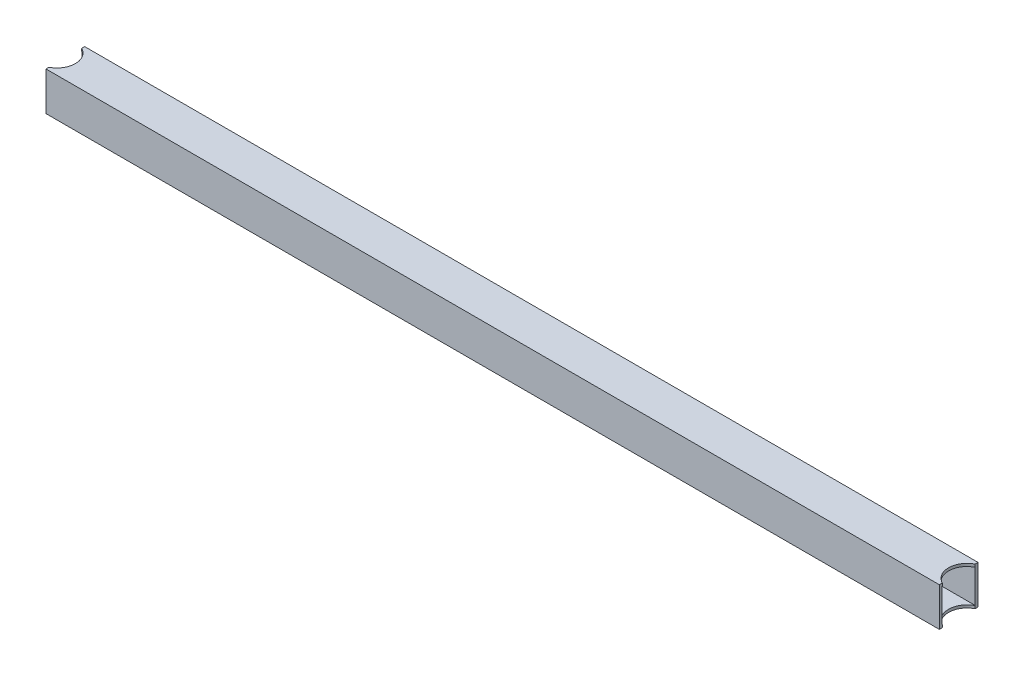
ISO-10303-21;
HEADER;
FILE_DESCRIPTION(('STEP AP214'),'2;1');
FILE_NAME('part.step','',(''),(''),'','','');
FILE_SCHEMA(('AUTOMOTIVE_DESIGN { 1 0 10303 214 1 1 1 1 }'));
ENDSEC;
DATA;
#1=APPLICATION_CONTEXT('core data for automotive mechanical design processes');
#2=APPLICATION_PROTOCOL_DEFINITION('international standard','automotive_design',2000,#1);
#3=PRODUCT_CONTEXT('',#1,'mechanical');
#4=PRODUCT('Part','Part','',(#3));
#5=PRODUCT_RELATED_PRODUCT_CATEGORY('part','',(#4));
#6=PRODUCT_DEFINITION_FORMATION('','',#4);
#7=PRODUCT_DEFINITION_CONTEXT('part definition',#1,'design');
#8=PRODUCT_DEFINITION('design','',#6,#7);
#9=PRODUCT_DEFINITION_SHAPE('','',#8);
#10=(LENGTH_UNIT() NAMED_UNIT(*) SI_UNIT(.MILLI.,.METRE.));
#11=(NAMED_UNIT(*) PLANE_ANGLE_UNIT() SI_UNIT($,.RADIAN.));
#12=(NAMED_UNIT(*) SI_UNIT($,.STERADIAN.) SOLID_ANGLE_UNIT());
#13=UNCERTAINTY_MEASURE_WITH_UNIT(LENGTH_MEASURE(1.E-05),#10,'distance_accuracy_value','');
#14=(GEOMETRIC_REPRESENTATION_CONTEXT(3) GLOBAL_UNCERTAINTY_ASSIGNED_CONTEXT((#13)) GLOBAL_UNIT_ASSIGNED_CONTEXT((#10,
#11,#12)) REPRESENTATION_CONTEXT('',''));
#15=CARTESIAN_POINT('',(0.,0.,0.));
#16=DIRECTION('',(0.,0.,1.));
#17=DIRECTION('',(1.,0.,0.));
#18=AXIS2_PLACEMENT_3D('',#15,#16,#17);
#19=CARTESIAN_POINT('',(522.605,44.45,0.));
#20=DIRECTION('',(0.,-1.,0.));
#21=DIRECTION('',(0.,0.,-1.));
#22=AXIS2_PLACEMENT_3D('',#19,#20,#21);
#23=CYLINDRICAL_SURFACE('',#22,21.0820000000003);
#24=DIRECTION('',(0.,-1.,0.));
#25=VECTOR('',#24,1.);
#26=CARTESIAN_POINT('',(513.08,44.45,-18.8075808917575));
#27=LINE('',#26,#25);
#28=CARTESIAN_POINT('',(513.08,3.17500000000004,-18.8075808917575));
#29=VERTEX_POINT('',#28);
#30=CARTESIAN_POINT('',(513.08,0.,-18.8075808917575));
#31=VERTEX_POINT('',#30);
#32=EDGE_CURVE('E338',#29,#31,#27,.T.);
#33=ORIENTED_EDGE('',*,*,#32,.F.);
#34=CARTESIAN_POINT('',(522.605,3.17500000000004,0.));
#35=DIRECTION('',(0.,-1.,0.));
#36=DIRECTION('',(0.,0.,-1.));
#37=AXIS2_PLACEMENT_3D('',#34,#35,#36);
#38=CIRCLE('',#37,21.0820000000003);
#39=CARTESIAN_POINT('',(513.08,3.17500000000004,18.8075808917578));
#40=VERTEX_POINT('',#39);
#41=EDGE_CURVE('E253',#29,#40,#38,.F.);
#42=ORIENTED_EDGE('',*,*,#41,.T.);
#43=DIRECTION('',(0.,-1.,0.));
#44=VECTOR('',#43,1.);
#45=CARTESIAN_POINT('',(513.08,44.45,18.8075808917575));
#46=LINE('',#45,#44);
#47=CARTESIAN_POINT('',(513.08,0.,18.8075808917575));
#48=VERTEX_POINT('',#47);
#49=EDGE_CURVE('E209',#40,#48,#46,.T.);
#50=ORIENTED_EDGE('',*,*,#49,.T.);
#51=CARTESIAN_POINT('',(522.605,0.,0.));
#52=DIRECTION('',(0.,1.,0.));
#53=DIRECTION('',(0.,0.,1.));
#54=AXIS2_PLACEMENT_3D('',#51,#52,#53);
#55=CIRCLE('',#54,21.0820000000003);
#56=EDGE_CURVE('E290',#48,#31,#55,.F.);
#57=ORIENTED_EDGE('',*,*,#56,.T.);
#58=EDGE_LOOP('',(#33,#42,#50,#57));
#59=FACE_BOUND('',#58,.T.);
#60=ADVANCED_FACE('F42',(#59),#23,.F.);
#61=CARTESIAN_POINT('',(-522.605,44.45,1.28369537222284E-13));
#62=DIRECTION('',(0.,-1.,0.));
#63=DIRECTION('',(0.,0.,-1.));
#64=AXIS2_PLACEMENT_3D('',#61,#62,#63);
#65=CYLINDRICAL_SURFACE('',#64,21.0819999999999);
#66=CARTESIAN_POINT('',(-522.605,3.17500000000004,1.28369537222284E-13));
#67=DIRECTION('',(0.,-1.,0.));
#68=DIRECTION('',(0.,0.,-1.));
#69=AXIS2_PLACEMENT_3D('',#66,#67,#68);
#70=CIRCLE('',#69,21.0819999999999);
#71=CARTESIAN_POINT('',(-513.08,3.17500000000004,-18.8075808917573));
#72=VERTEX_POINT('',#71);
#73=CARTESIAN_POINT('',(-513.08,3.17500000000004,18.8075808917576));
#74=VERTEX_POINT('',#73);
#75=EDGE_CURVE('E250',#72,#74,#70,.T.);
#76=ORIENTED_EDGE('',*,*,#75,.F.);
#77=DIRECTION('',(0.,-1.,0.));
#78=VECTOR('',#77,1.);
#79=CARTESIAN_POINT('',(-513.08,44.45,-18.8075808917574));
#80=LINE('',#79,#78);
#81=CARTESIAN_POINT('',(-513.08,0.,-18.8075808917574));
#82=VERTEX_POINT('',#81);
#83=EDGE_CURVE('E326',#72,#82,#80,.T.);
#84=ORIENTED_EDGE('',*,*,#83,.T.);
#85=CARTESIAN_POINT('',(-522.605,0.,1.28369537222284E-13));
#86=DIRECTION('',(0.,1.,0.));
#87=DIRECTION('',(0.,0.,1.));
#88=AXIS2_PLACEMENT_3D('',#85,#86,#87);
#89=CIRCLE('',#88,21.0819999999999);
#90=CARTESIAN_POINT('',(-513.08,0.,18.8075808917576));
#91=VERTEX_POINT('',#90);
#92=EDGE_CURVE('E305',#91,#82,#89,.T.);
#93=ORIENTED_EDGE('',*,*,#92,.F.);
#94=DIRECTION('',(0.,-1.,0.));
#95=VECTOR('',#94,1.);
#96=CARTESIAN_POINT('',(-513.08,44.45,18.8075808917576));
#97=LINE('',#96,#95);
#98=EDGE_CURVE('E321',#74,#91,#97,.T.);
#99=ORIENTED_EDGE('',*,*,#98,.F.);
#100=EDGE_LOOP('',(#76,#84,#93,#99));
#101=FACE_BOUND('',#100,.T.);
#102=ADVANCED_FACE('F369',(#101),#65,.F.);
#103=CARTESIAN_POINT('',(513.08,44.45,0.));
#104=DIRECTION('',(-1.,0.,0.));
#105=DIRECTION('',(0.,0.,1.));
#106=AXIS2_PLACEMENT_3D('',#103,#104,#105);
#107=PLANE('',#106);
#108=ORIENTED_EDGE('',*,*,#49,.F.);
#109=DIRECTION('',(0.,0.,1.));
#110=VECTOR('',#109,1.);
#111=CARTESIAN_POINT('',(513.08,3.17500000000004,-19.0499999999999));
#112=LINE('',#111,#110);
#113=CARTESIAN_POINT('',(513.08,3.17500000000004,19.0500000000002));
#114=VERTEX_POINT('',#113);
#115=EDGE_CURVE('E190',#40,#114,#112,.T.);
#116=ORIENTED_EDGE('',*,*,#115,.T.);
#117=DIRECTION('',(0.,1.,0.));
#118=VECTOR('',#117,1.);
#119=CARTESIAN_POINT('',(513.08,3.17500000000004,19.0500000000002));
#120=LINE('',#119,#118);
#121=CARTESIAN_POINT('',(513.08,41.2749999999999,19.0500000000002));
#122=VERTEX_POINT('',#121);
#123=EDGE_CURVE('E198',#114,#122,#120,.T.);
#124=ORIENTED_EDGE('',*,*,#123,.T.);
#125=DIRECTION('',(0.,0.,-1.));
#126=VECTOR('',#125,1.);
#127=CARTESIAN_POINT('',(513.08,41.2749999999999,-19.0499999999999));
#128=LINE('',#127,#126);
#129=CARTESIAN_POINT('',(513.08,41.2749999999999,18.8075808917578));
#130=VERTEX_POINT('',#129);
#131=EDGE_CURVE('E221',#122,#130,#128,.T.);
#132=ORIENTED_EDGE('',*,*,#131,.T.);
#133=CARTESIAN_POINT('',(513.08,44.45,18.8075808917575));
#134=VERTEX_POINT('',#133);
#135=EDGE_CURVE('E51',#134,#130,#46,.T.);
#136=ORIENTED_EDGE('',*,*,#135,.F.);
#137=DIRECTION('',(0.,0.,-1.));
#138=VECTOR('',#137,1.);
#139=CARTESIAN_POINT('',(513.08,44.45,0.));
#140=LINE('',#139,#138);
#141=CARTESIAN_POINT('',(513.08,44.45,22.225));
#142=VERTEX_POINT('',#141);
#143=EDGE_CURVE('E257',#142,#134,#140,.T.);
#144=ORIENTED_EDGE('',*,*,#143,.F.);
#145=DIRECTION('',(0.,-1.,0.));
#146=VECTOR('',#145,1.);
#147=CARTESIAN_POINT('',(513.08,44.45,22.225));
#148=LINE('',#147,#146);
#149=CARTESIAN_POINT('',(513.08,0.,22.225));
#150=VERTEX_POINT('',#149);
#151=EDGE_CURVE('E287',#142,#150,#148,.T.);
#152=ORIENTED_EDGE('',*,*,#151,.T.);
#153=DIRECTION('',(0.,0.,-1.));
#154=VECTOR('',#153,1.);
#155=CARTESIAN_POINT('',(513.08,0.,0.));
#156=LINE('',#155,#154);
#157=EDGE_CURVE('E256',#150,#48,#156,.T.);
#158=ORIENTED_EDGE('',*,*,#157,.T.);
#159=EDGE_LOOP('',(#108,#116,#124,#132,#136,#144,#152,#158));
#160=FACE_BOUND('',#159,.T.);
#161=ADVANCED_FACE('F44',(#160),#107,.F.);
#162=ORIENTED_EDGE('',*,*,#135,.T.);
#163=CARTESIAN_POINT('',(522.605,41.2749999999999,0.));
#164=DIRECTION('',(0.,1.,0.));
#165=DIRECTION('',(0.,0.,1.));
#166=AXIS2_PLACEMENT_3D('',#163,#164,#165);
#167=CIRCLE('',#166,21.0820000000003);
#168=CARTESIAN_POINT('',(513.08,41.2749999999999,-18.8075808917575));
#169=VERTEX_POINT('',#168);
#170=EDGE_CURVE('E246',#130,#169,#167,.F.);
#171=ORIENTED_EDGE('',*,*,#170,.T.);
#172=CARTESIAN_POINT('',(513.08,44.45,-18.8075808917575));
#173=VERTEX_POINT('',#172);
#174=EDGE_CURVE('E339',#173,#169,#27,.T.);
#175=ORIENTED_EDGE('',*,*,#174,.F.);
#176=CARTESIAN_POINT('',(522.605,44.45,0.));
#177=DIRECTION('',(0.,1.,0.));
#178=DIRECTION('',(0.,0.,1.));
#179=AXIS2_PLACEMENT_3D('',#176,#177,#178);
#180=CIRCLE('',#179,21.0820000000003);
#181=EDGE_CURVE('E261',#134,#173,#180,.F.);
#182=ORIENTED_EDGE('',*,*,#181,.F.);
#183=EDGE_LOOP('',(#162,#171,#175,#182));
#184=FACE_BOUND('',#183,.T.);
#185=ADVANCED_FACE('F393',(#184),#23,.F.);
#186=CARTESIAN_POINT('',(513.08,44.45,0.));
#187=DIRECTION('',(1.,0.,0.));
#188=DIRECTION('',(0.,0.,-1.));
#189=AXIS2_PLACEMENT_3D('',#186,#187,#188);
#190=PLANE('',#189);
#191=CARTESIAN_POINT('',(513.08,3.17500000000004,-19.0499999999999));
#192=VERTEX_POINT('',#191);
#193=EDGE_CURVE('E205',#192,#29,#112,.T.);
#194=ORIENTED_EDGE('',*,*,#193,.T.);
#195=ORIENTED_EDGE('',*,*,#32,.T.);
#196=DIRECTION('',(0.,0.,1.));
#197=VECTOR('',#196,1.);
#198=CARTESIAN_POINT('',(513.08,0.,0.));
#199=LINE('',#198,#197);
#200=CARTESIAN_POINT('',(513.08,0.,-22.225));
#201=VERTEX_POINT('',#200);
#202=EDGE_CURVE('E294',#201,#31,#199,.T.);
#203=ORIENTED_EDGE('',*,*,#202,.F.);
#204=DIRECTION('',(0.,-1.,0.));
#205=VECTOR('',#204,1.);
#206=CARTESIAN_POINT('',(513.08,44.45,-22.225));
#207=LINE('',#206,#205);
#208=CARTESIAN_POINT('',(513.08,44.45,-22.225));
#209=VERTEX_POINT('',#208);
#210=EDGE_CURVE('E335',#209,#201,#207,.T.);
#211=ORIENTED_EDGE('',*,*,#210,.F.);
#212=DIRECTION('',(0.,0.,1.));
#213=VECTOR('',#212,1.);
#214=CARTESIAN_POINT('',(513.08,44.45,0.));
#215=LINE('',#214,#213);
#216=EDGE_CURVE('E265',#209,#173,#215,.T.);
#217=ORIENTED_EDGE('',*,*,#216,.T.);
#218=ORIENTED_EDGE('',*,*,#174,.T.);
#219=CARTESIAN_POINT('',(513.08,41.2749999999999,-19.0499999999999));
#220=VERTEX_POINT('',#219);
#221=EDGE_CURVE('E204',#169,#220,#128,.T.);
#222=ORIENTED_EDGE('',*,*,#221,.T.);
#223=DIRECTION('',(0.,-1.,0.));
#224=VECTOR('',#223,1.);
#225=CARTESIAN_POINT('',(513.08,3.17500000000004,-19.0499999999999));
#226=LINE('',#225,#224);
#227=EDGE_CURVE('E61',#220,#192,#226,.T.);
#228=ORIENTED_EDGE('',*,*,#227,.T.);
#229=EDGE_LOOP('',(#194,#195,#203,#211,#217,#218,#222,#228));
#230=FACE_BOUND('',#229,.T.);
#231=ADVANCED_FACE('F379',(#230),#190,.T.);
#232=CARTESIAN_POINT('',(0.,44.45,-22.225));
#233=DIRECTION('',(0.,0.,1.));
#234=DIRECTION('',(1.,0.,0.));
#235=AXIS2_PLACEMENT_3D('',#232,#233,#234);
#236=PLANE('',#235);
#237=DIRECTION('',(-1.,0.,0.));
#238=VECTOR('',#237,1.);
#239=CARTESIAN_POINT('',(0.,0.,-22.225));
#240=LINE('',#239,#238);
#241=CARTESIAN_POINT('',(-513.08,0.,-22.2249999999999));
#242=VERTEX_POINT('',#241);
#243=EDGE_CURVE('E298',#201,#242,#240,.T.);
#244=ORIENTED_EDGE('',*,*,#243,.T.);
#245=DIRECTION('',(0.,-1.,0.));
#246=VECTOR('',#245,1.);
#247=CARTESIAN_POINT('',(-513.08,44.45,-22.2249999999999));
#248=LINE('',#247,#246);
#249=CARTESIAN_POINT('',(-513.08,44.45,-22.2249999999999));
#250=VERTEX_POINT('',#249);
#251=EDGE_CURVE('E331',#250,#242,#248,.T.);
#252=ORIENTED_EDGE('',*,*,#251,.F.);
#253=DIRECTION('',(-1.,0.,0.));
#254=VECTOR('',#253,1.);
#255=CARTESIAN_POINT('',(0.,44.45,-22.225));
#256=LINE('',#255,#254);
#257=EDGE_CURVE('E269',#209,#250,#256,.T.);
#258=ORIENTED_EDGE('',*,*,#257,.F.);
#259=ORIENTED_EDGE('',*,*,#210,.T.);
#260=EDGE_LOOP('',(#244,#252,#258,#259));
#261=FACE_BOUND('',#260,.T.);
#262=ADVANCED_FACE('F408',(#261),#236,.F.);
#263=CARTESIAN_POINT('',(-513.08,44.45,0.));
#264=DIRECTION('',(1.,0.,0.));
#265=DIRECTION('',(0.,0.,-1.));
#266=AXIS2_PLACEMENT_3D('',#263,#264,#265);
#267=PLANE('',#266);
#268=ORIENTED_EDGE('',*,*,#83,.F.);
#269=DIRECTION('',(0.,0.,1.));
#270=VECTOR('',#269,1.);
#271=CARTESIAN_POINT('',(-513.08,3.17500000000004,-19.0499999999999));
#272=LINE('',#271,#270);
#273=CARTESIAN_POINT('',(-513.08,3.17500000000004,-19.0499999999999));
#274=VERTEX_POINT('',#273);
#275=EDGE_CURVE('E226',#274,#72,#272,.T.);
#276=ORIENTED_EDGE('',*,*,#275,.F.);
#277=DIRECTION('',(0.,-1.,0.));
#278=VECTOR('',#277,1.);
#279=CARTESIAN_POINT('',(-513.08,3.17500000000004,-19.0499999999999));
#280=LINE('',#279,#278);
#281=CARTESIAN_POINT('',(-513.08,41.2749999999999,-19.0499999999999));
#282=VERTEX_POINT('',#281);
#283=EDGE_CURVE('E211',#282,#274,#280,.T.);
#284=ORIENTED_EDGE('',*,*,#283,.F.);
#285=DIRECTION('',(0.,0.,-1.));
#286=VECTOR('',#285,1.);
#287=CARTESIAN_POINT('',(-513.08,41.2749999999999,-19.0499999999999));
#288=LINE('',#287,#286);
#289=CARTESIAN_POINT('',(-513.08,41.2749999999999,-18.8075808917573));
#290=VERTEX_POINT('',#289);
#291=EDGE_CURVE('E232',#290,#282,#288,.T.);
#292=ORIENTED_EDGE('',*,*,#291,.F.);
#293=CARTESIAN_POINT('',(-513.08,44.45,-18.8075808917574));
#294=VERTEX_POINT('',#293);
#295=EDGE_CURVE('E327',#294,#290,#80,.T.);
#296=ORIENTED_EDGE('',*,*,#295,.F.);
#297=DIRECTION('',(0.,0.,1.));
#298=VECTOR('',#297,1.);
#299=CARTESIAN_POINT('',(-513.08,44.45,0.));
#300=LINE('',#299,#298);
#301=EDGE_CURVE('E272',#250,#294,#300,.T.);
#302=ORIENTED_EDGE('',*,*,#301,.F.);
#303=ORIENTED_EDGE('',*,*,#251,.T.);
#304=DIRECTION('',(0.,0.,1.));
#305=VECTOR('',#304,1.);
#306=CARTESIAN_POINT('',(-513.08,0.,0.));
#307=LINE('',#306,#305);
#308=EDGE_CURVE('E301',#242,#82,#307,.T.);
#309=ORIENTED_EDGE('',*,*,#308,.T.);
#310=EDGE_LOOP('',(#268,#276,#284,#292,#296,#302,#303,#309));
#311=FACE_BOUND('',#310,.T.);
#312=ADVANCED_FACE('F374',(#311),#267,.F.);
#313=CARTESIAN_POINT('',(-522.605,41.2749999999999,1.28369537222284E-13));
#314=DIRECTION('',(0.,1.,0.));
#315=DIRECTION('',(0.,0.,1.));
#316=AXIS2_PLACEMENT_3D('',#313,#314,#315);
#317=CIRCLE('',#316,21.0819999999999);
#318=CARTESIAN_POINT('',(-513.08,41.2749999999999,18.8075808917576));
#319=VERTEX_POINT('',#318);
#320=EDGE_CURVE('E238',#319,#290,#317,.T.);
#321=ORIENTED_EDGE('',*,*,#320,.F.);
#322=CARTESIAN_POINT('',(-513.08,44.45,18.8075808917576));
#323=VERTEX_POINT('',#322);
#324=EDGE_CURVE('E322',#323,#319,#97,.T.);
#325=ORIENTED_EDGE('',*,*,#324,.F.);
#326=CARTESIAN_POINT('',(-522.605,44.45,1.28369537222284E-13));
#327=DIRECTION('',(0.,1.,0.));
#328=DIRECTION('',(0.,0.,1.));
#329=AXIS2_PLACEMENT_3D('',#326,#327,#328);
#330=CIRCLE('',#329,21.0819999999999);
#331=EDGE_CURVE('E275',#323,#294,#330,.T.);
#332=ORIENTED_EDGE('',*,*,#331,.T.);
#333=ORIENTED_EDGE('',*,*,#295,.T.);
#334=EDGE_LOOP('',(#321,#325,#332,#333));
#335=FACE_BOUND('',#334,.T.);
#336=ADVANCED_FACE('F400',(#335),#65,.F.);
#337=CARTESIAN_POINT('',(-513.08,44.45,0.));
#338=DIRECTION('',(-1.,0.,0.));
#339=DIRECTION('',(0.,0.,1.));
#340=AXIS2_PLACEMENT_3D('',#337,#338,#339);
#341=PLANE('',#340);
#342=DIRECTION('',(0.,0.,1.));
#343=VECTOR('',#342,1.);
#344=CARTESIAN_POINT('',(-513.08,3.17500000000004,0.));
#345=LINE('',#344,#343);
#346=CARTESIAN_POINT('',(-513.08,3.17500000000004,19.0500000000002));
#347=VERTEX_POINT('',#346);
#348=EDGE_CURVE('E11',#74,#347,#345,.T.);
#349=ORIENTED_EDGE('',*,*,#348,.F.);
#350=ORIENTED_EDGE('',*,*,#98,.T.);
#351=DIRECTION('',(0.,0.,-1.));
#352=VECTOR('',#351,1.);
#353=CARTESIAN_POINT('',(-513.08,0.,0.));
#354=LINE('',#353,#352);
#355=CARTESIAN_POINT('',(-513.08,0.,22.2250000000002));
#356=VERTEX_POINT('',#355);
#357=EDGE_CURVE('E309',#356,#91,#354,.T.);
#358=ORIENTED_EDGE('',*,*,#357,.F.);
#359=DIRECTION('',(0.,-1.,0.));
#360=VECTOR('',#359,1.);
#361=CARTESIAN_POINT('',(-513.08,44.45,22.2250000000002));
#362=LINE('',#361,#360);
#363=CARTESIAN_POINT('',(-513.08,44.45,22.2250000000002));
#364=VERTEX_POINT('',#363);
#365=EDGE_CURVE('E318',#364,#356,#362,.T.);
#366=ORIENTED_EDGE('',*,*,#365,.F.);
#367=DIRECTION('',(0.,0.,-1.));
#368=VECTOR('',#367,1.);
#369=CARTESIAN_POINT('',(-513.08,44.45,0.));
#370=LINE('',#369,#368);
#371=EDGE_CURVE('E279',#364,#323,#370,.T.);
#372=ORIENTED_EDGE('',*,*,#371,.T.);
#373=ORIENTED_EDGE('',*,*,#324,.T.);
#374=CARTESIAN_POINT('',(-513.08,41.2749999999999,19.0500000000002));
#375=VERTEX_POINT('',#374);
#376=EDGE_CURVE('E218',#375,#319,#288,.T.);
#377=ORIENTED_EDGE('',*,*,#376,.F.);
#378=DIRECTION('',(0.,1.,0.));
#379=VECTOR('',#378,1.);
#380=CARTESIAN_POINT('',(-513.08,3.17500000000004,19.0500000000002));
#381=LINE('',#380,#379);
#382=EDGE_CURVE('E229',#347,#375,#381,.T.);
#383=ORIENTED_EDGE('',*,*,#382,.F.);
#384=EDGE_LOOP('',(#349,#350,#358,#366,#372,#373,#377,#383));
#385=FACE_BOUND('',#384,.T.);
#386=ADVANCED_FACE('F363',(#385),#341,.T.);
#387=CARTESIAN_POINT('',(0.,44.45,22.2250000000001));
#388=DIRECTION('',(0.,0.,1.));
#389=DIRECTION('',(1.,0.,0.));
#390=AXIS2_PLACEMENT_3D('',#387,#388,#389);
#391=PLANE('',#390);
#392=DIRECTION('',(-1.,0.,0.));
#393=VECTOR('',#392,1.);
#394=CARTESIAN_POINT('',(0.,0.,22.2250000000001));
#395=LINE('',#394,#393);
#396=EDGE_CURVE('E262',#150,#356,#395,.T.);
#397=ORIENTED_EDGE('',*,*,#396,.F.);
#398=ORIENTED_EDGE('',*,*,#151,.F.);
#399=DIRECTION('',(-1.,0.,0.));
#400=VECTOR('',#399,1.);
#401=CARTESIAN_POINT('',(0.,44.45,22.2250000000001));
#402=LINE('',#401,#400);
#403=EDGE_CURVE('E283',#142,#364,#402,.T.);
#404=ORIENTED_EDGE('',*,*,#403,.T.);
#405=ORIENTED_EDGE('',*,*,#365,.T.);
#406=EDGE_LOOP('',(#397,#398,#404,#405));
#407=FACE_BOUND('',#406,.T.);
#408=ADVANCED_FACE('F358',(#407),#391,.T.);
#409=CARTESIAN_POINT('',(0.,44.45,0.));
#410=DIRECTION('',(0.,1.,0.));
#411=DIRECTION('',(0.,0.,1.));
#412=AXIS2_PLACEMENT_3D('',#409,#410,#411);
#413=PLANE('',#412);
#414=ORIENTED_EDGE('',*,*,#143,.T.);
#415=ORIENTED_EDGE('',*,*,#181,.T.);
#416=ORIENTED_EDGE('',*,*,#216,.F.);
#417=ORIENTED_EDGE('',*,*,#257,.T.);
#418=ORIENTED_EDGE('',*,*,#301,.T.);
#419=ORIENTED_EDGE('',*,*,#331,.F.);
#420=ORIENTED_EDGE('',*,*,#371,.F.);
#421=ORIENTED_EDGE('',*,*,#403,.F.);
#422=EDGE_LOOP('',(#414,#415,#416,#417,#418,#419,#420,#421));
#423=FACE_BOUND('',#422,.T.);
#424=ADVANCED_FACE('F396',(#423),#413,.T.);
#425=CARTESIAN_POINT('',(0.,0.,0.));
#426=DIRECTION('',(0.,1.,0.));
#427=DIRECTION('',(0.,0.,1.));
#428=AXIS2_PLACEMENT_3D('',#425,#426,#427);
#429=PLANE('',#428);
#430=ORIENTED_EDGE('',*,*,#157,.F.);
#431=ORIENTED_EDGE('',*,*,#396,.T.);
#432=ORIENTED_EDGE('',*,*,#357,.T.);
#433=ORIENTED_EDGE('',*,*,#92,.T.);
#434=ORIENTED_EDGE('',*,*,#308,.F.);
#435=ORIENTED_EDGE('',*,*,#243,.F.);
#436=ORIENTED_EDGE('',*,*,#202,.T.);
#437=ORIENTED_EDGE('',*,*,#56,.F.);
#438=EDGE_LOOP('',(#430,#431,#432,#433,#434,#435,#436,#437));
#439=FACE_BOUND('',#438,.T.);
#440=ADVANCED_FACE('F351',(#439),#429,.F.);
#441=CARTESIAN_POINT('',(513.08,3.17500000000004,-19.0499999999999));
#442=DIRECTION('',(0.,-1.,0.));
#443=DIRECTION('',(0.,0.,-1.));
#444=AXIS2_PLACEMENT_3D('',#441,#442,#443);
#445=PLANE('',#444);
#446=ORIENTED_EDGE('',*,*,#193,.F.);
#447=DIRECTION('',(-1.,0.,0.));
#448=VECTOR('',#447,1.);
#449=CARTESIAN_POINT('',(513.08,3.17500000000004,-19.0499999999999));
#450=LINE('',#449,#448);
#451=EDGE_CURVE('E235',#192,#274,#450,.T.);
#452=ORIENTED_EDGE('',*,*,#451,.T.);
#453=ORIENTED_EDGE('',*,*,#275,.T.);
#454=ORIENTED_EDGE('',*,*,#75,.T.);
#455=ORIENTED_EDGE('',*,*,#348,.T.);
#456=DIRECTION('',(-1.,0.,0.));
#457=VECTOR('',#456,1.);
#458=CARTESIAN_POINT('',(513.08,3.17500000000004,19.0500000000002));
#459=LINE('',#458,#457);
#460=EDGE_CURVE('E72',#114,#347,#459,.T.);
#461=ORIENTED_EDGE('',*,*,#460,.F.);
#462=ORIENTED_EDGE('',*,*,#115,.F.);
#463=ORIENTED_EDGE('',*,*,#41,.F.);
#464=EDGE_LOOP('',(#446,#452,#453,#454,#455,#461,#462,#463));
#465=FACE_BOUND('',#464,.T.);
#466=ADVANCED_FACE('F188',(#465),#445,.F.);
#467=CARTESIAN_POINT('',(513.08,41.2749999999999,-19.0499999999999));
#468=DIRECTION('',(0.,1.,0.));
#469=DIRECTION('',(0.,0.,1.));
#470=AXIS2_PLACEMENT_3D('',#467,#468,#469);
#471=PLANE('',#470);
#472=ORIENTED_EDGE('',*,*,#131,.F.);
#473=DIRECTION('',(-1.,0.,0.));
#474=VECTOR('',#473,1.);
#475=CARTESIAN_POINT('',(513.08,41.2749999999999,19.0500000000002));
#476=LINE('',#475,#474);
#477=EDGE_CURVE('E195',#122,#375,#476,.T.);
#478=ORIENTED_EDGE('',*,*,#477,.T.);
#479=ORIENTED_EDGE('',*,*,#376,.T.);
#480=ORIENTED_EDGE('',*,*,#320,.T.);
#481=ORIENTED_EDGE('',*,*,#291,.T.);
#482=DIRECTION('',(-1.,0.,0.));
#483=VECTOR('',#482,1.);
#484=CARTESIAN_POINT('',(513.08,41.2749999999999,-19.0499999999999));
#485=LINE('',#484,#483);
#486=EDGE_CURVE('E239',#220,#282,#485,.T.);
#487=ORIENTED_EDGE('',*,*,#486,.F.);
#488=ORIENTED_EDGE('',*,*,#221,.F.);
#489=ORIENTED_EDGE('',*,*,#170,.F.);
#490=EDGE_LOOP('',(#472,#478,#479,#480,#481,#487,#488,#489));
#491=FACE_BOUND('',#490,.T.);
#492=ADVANCED_FACE('F385',(#491),#471,.F.);
#493=CARTESIAN_POINT('',(513.08,3.17500000000004,-19.0499999999999));
#494=DIRECTION('',(0.,0.,-1.));
#495=DIRECTION('',(-1.,0.,0.));
#496=AXIS2_PLACEMENT_3D('',#493,#494,#495);
#497=PLANE('',#496);
#498=ORIENTED_EDGE('',*,*,#283,.T.);
#499=ORIENTED_EDGE('',*,*,#451,.F.);
#500=ORIENTED_EDGE('',*,*,#227,.F.);
#501=ORIENTED_EDGE('',*,*,#486,.T.);
#502=EDGE_LOOP('',(#498,#499,#500,#501));
#503=FACE_BOUND('',#502,.T.);
#504=ADVANCED_FACE('F390',(#503),#497,.F.);
#505=CARTESIAN_POINT('',(513.08,3.17500000000004,19.0500000000002));
#506=DIRECTION('',(0.,0.,1.));
#507=DIRECTION('',(1.,0.,0.));
#508=AXIS2_PLACEMENT_3D('',#505,#506,#507);
#509=PLANE('',#508);
#510=ORIENTED_EDGE('',*,*,#382,.T.);
#511=ORIENTED_EDGE('',*,*,#477,.F.);
#512=ORIENTED_EDGE('',*,*,#123,.F.);
#513=ORIENTED_EDGE('',*,*,#460,.T.);
#514=EDGE_LOOP('',(#510,#511,#512,#513));
#515=FACE_BOUND('',#514,.T.);
#516=ADVANCED_FACE('F199',(#515),#509,.F.);
#517=CLOSED_SHELL('',(#60,#102,#161,#185,#231,#262,#312,#336,#386,#408,#424,#440,#466,#492,#504,#516));
#518=MANIFOLD_SOLID_BREP('B2',#517);
#519=ADVANCED_BREP_SHAPE_REPRESENTATION('',(#18,#518),#14);
#520=SHAPE_DEFINITION_REPRESENTATION(#9,#519);
ENDSEC;
END-ISO-10303-21;
